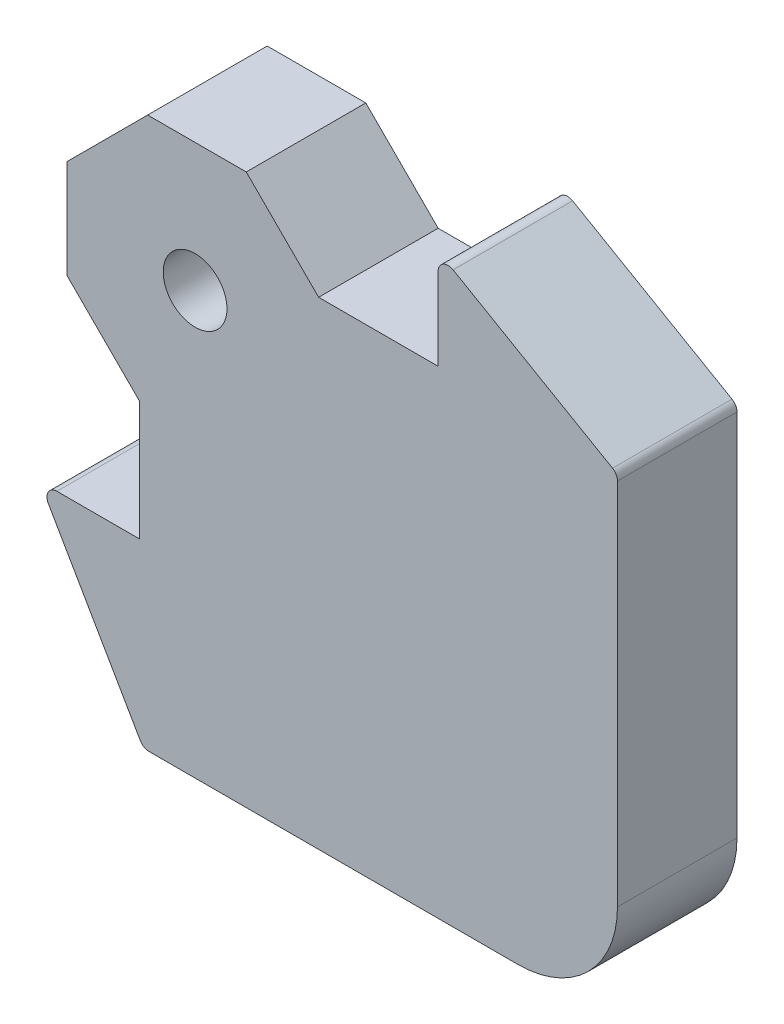
ISO-10303-21;
HEADER;
FILE_DESCRIPTION(('STEP AP214'),'2;1');
FILE_NAME('part.step','',(''),(''),'','','');
FILE_SCHEMA(('AUTOMOTIVE_DESIGN { 1 0 10303 214 1 1 1 1 }'));
ENDSEC;
DATA;
#1=APPLICATION_CONTEXT('core data for automotive mechanical design processes');
#2=APPLICATION_PROTOCOL_DEFINITION('international standard','automotive_design',2000,#1);
#3=PRODUCT_CONTEXT('',#1,'mechanical');
#4=PRODUCT('Part','Part','',(#3));
#5=PRODUCT_RELATED_PRODUCT_CATEGORY('part','',(#4));
#6=PRODUCT_DEFINITION_FORMATION('','',#4);
#7=PRODUCT_DEFINITION_CONTEXT('part definition',#1,'design');
#8=PRODUCT_DEFINITION('design','',#6,#7);
#9=PRODUCT_DEFINITION_SHAPE('','',#8);
#10=(LENGTH_UNIT() NAMED_UNIT(*) SI_UNIT(.MILLI.,.METRE.));
#11=(NAMED_UNIT(*) PLANE_ANGLE_UNIT() SI_UNIT($,.RADIAN.));
#12=(NAMED_UNIT(*) SI_UNIT($,.STERADIAN.) SOLID_ANGLE_UNIT());
#13=UNCERTAINTY_MEASURE_WITH_UNIT(LENGTH_MEASURE(1.E-05),#10,'distance_accuracy_value','');
#14=(GEOMETRIC_REPRESENTATION_CONTEXT(3) GLOBAL_UNCERTAINTY_ASSIGNED_CONTEXT((#13)) GLOBAL_UNIT_ASSIGNED_CONTEXT((#10,
#11,#12)) REPRESENTATION_CONTEXT('',''));
#15=CARTESIAN_POINT('',(0.,0.,0.));
#16=DIRECTION('',(0.,0.,1.));
#17=DIRECTION('',(1.,0.,0.));
#18=AXIS2_PLACEMENT_3D('',#15,#16,#17);
#19=CARTESIAN_POINT('',(0.,0.,3.));
#20=DIRECTION('',(0.,0.,-1.));
#21=DIRECTION('',(-1.,0.,0.));
#22=AXIS2_PLACEMENT_3D('',#19,#20,#21);
#23=PLANE('',#22);
#24=DIRECTION('',(-0.707106781186547,-0.707106781186547,0.));
#25=VECTOR('',#24,1.);
#26=CARTESIAN_POINT('',(-21.2132034355964,0.,3.));
#27=LINE('',#26,#25);
#28=CARTESIAN_POINT('',(-8.58147545195114,12.6317279836453,3.));
#29=VERTEX_POINT('',#28);
#30=CARTESIAN_POINT('',(-12.6317279836453,8.58147545195113,3.));
#31=VERTEX_POINT('',#30);
#32=EDGE_CURVE('E244',#29,#31,#27,.T.);
#33=ORIENTED_EDGE('',*,*,#32,.T.);
#34=DIRECTION('',(0.,1.,0.));
#35=VECTOR('',#34,1.);
#36=CARTESIAN_POINT('',(-12.6317279836453,8.58147545195113,3.));
#37=LINE('',#36,#35);
#38=CARTESIAN_POINT('',(-12.6317279836453,3.63172798364529,3.));
#39=VERTEX_POINT('',#38);
#40=EDGE_CURVE('E172',#31,#39,#37,.F.);
#41=ORIENTED_EDGE('',*,*,#40,.T.);
#42=DIRECTION('',(-0.707106781186548,0.707106781186547,0.));
#43=VECTOR('',#42,1.);
#44=CARTESIAN_POINT('',(-15.1066017177982,6.10660171779822,3.));
#45=LINE('',#44,#43);
#46=CARTESIAN_POINT('',(-9.,0.,3.));
#47=VERTEX_POINT('',#46);
#48=EDGE_CURVE('E158',#47,#39,#45,.T.);
#49=ORIENTED_EDGE('',*,*,#48,.F.);
#50=DIRECTION('',(0.,-1.,0.));
#51=VECTOR('',#50,1.);
#52=CARTESIAN_POINT('',(-9.,0.,3.));
#53=LINE('',#52,#51);
#54=CARTESIAN_POINT('',(-9.,-6.,3.));
#55=VERTEX_POINT('',#54);
#56=EDGE_CURVE('E170',#47,#55,#53,.T.);
#57=ORIENTED_EDGE('',*,*,#56,.T.);
#58=DIRECTION('',(-1.,0.,0.));
#59=VECTOR('',#58,1.);
#60=CARTESIAN_POINT('',(-9.,-6.,3.));
#61=LINE('',#60,#59);
#62=CARTESIAN_POINT('',(-13.1339745962156,-6.,3.));
#63=VERTEX_POINT('',#62);
#64=EDGE_CURVE('E177',#55,#63,#61,.T.);
#65=ORIENTED_EDGE('',*,*,#64,.T.);
#66=CARTESIAN_POINT('',(-13.1339745962156,-6.5,3.));
#67=DIRECTION('',(0.,0.,-1.));
#68=DIRECTION('',(-1.,0.,0.));
#69=AXIS2_PLACEMENT_3D('',#66,#67,#68);
#70=CIRCLE('',#69,0.5);
#71=CARTESIAN_POINT('',(-13.5669872981078,-6.75,3.));
#72=VERTEX_POINT('',#71);
#73=EDGE_CURVE('E266',#63,#72,#70,.F.);
#74=ORIENTED_EDGE('',*,*,#73,.T.);
#75=DIRECTION('',(0.500000000000004,-0.866025403784436,0.));
#76=VECTOR('',#75,1.);
#77=CARTESIAN_POINT('',(-14.,-6.,3.));
#78=LINE('',#77,#76);
#79=CARTESIAN_POINT('',(-8.94818514459072,-14.75,3.));
#80=VERTEX_POINT('',#79);
#81=EDGE_CURVE('E180',#72,#80,#78,.T.);
#82=ORIENTED_EDGE('',*,*,#81,.T.);
#83=CARTESIAN_POINT('',(-8.5151724426985,-14.5,3.));
#84=DIRECTION('',(0.,0.,-1.));
#85=DIRECTION('',(-1.,0.,0.));
#86=AXIS2_PLACEMENT_3D('',#83,#84,#85);
#87=CIRCLE('',#86,0.5);
#88=CARTESIAN_POINT('',(-8.5151724426985,-15.,3.));
#89=VERTEX_POINT('',#88);
#90=EDGE_CURVE('E270',#80,#89,#87,.F.);
#91=ORIENTED_EDGE('',*,*,#90,.T.);
#92=DIRECTION('',(1.,0.,0.));
#93=VECTOR('',#92,1.);
#94=CARTESIAN_POINT('',(-8.80384757729331,-15.,3.));
#95=LINE('',#94,#93);
#96=CARTESIAN_POINT('',(10.,-15.,3.));
#97=VERTEX_POINT('',#96);
#98=EDGE_CURVE('E191',#89,#97,#95,.T.);
#99=ORIENTED_EDGE('',*,*,#98,.T.);
#100=CARTESIAN_POINT('',(10.,-10.,3.));
#101=DIRECTION('',(0.,0.,1.));
#102=DIRECTION('',(-1.,0.,0.));
#103=AXIS2_PLACEMENT_3D('',#100,#101,#102);
#104=CIRCLE('',#103,5.);
#105=CARTESIAN_POINT('',(15.,-10.,3.));
#106=VERTEX_POINT('',#105);
#107=EDGE_CURVE('E193',#97,#106,#104,.T.);
#108=ORIENTED_EDGE('',*,*,#107,.T.);
#109=DIRECTION('',(0.,1.,0.));
#110=VECTOR('',#109,1.);
#111=CARTESIAN_POINT('',(15.,8.80384757729332,3.));
#112=LINE('',#111,#110);
#113=CARTESIAN_POINT('',(15.,8.5151724426985,3.));
#114=VERTEX_POINT('',#113);
#115=EDGE_CURVE('E195',#106,#114,#112,.T.);
#116=ORIENTED_EDGE('',*,*,#115,.T.);
#117=CARTESIAN_POINT('',(14.5,8.5151724426985,3.));
#118=DIRECTION('',(0.,0.,-1.));
#119=DIRECTION('',(-1.,0.,0.));
#120=AXIS2_PLACEMENT_3D('',#117,#118,#119);
#121=CIRCLE('',#120,0.5);
#122=CARTESIAN_POINT('',(14.75,8.94818514459072,3.));
#123=VERTEX_POINT('',#122);
#124=EDGE_CURVE('E268',#114,#123,#121,.F.);
#125=ORIENTED_EDGE('',*,*,#124,.T.);
#126=DIRECTION('',(-0.866025403784436,0.500000000000004,0.));
#127=VECTOR('',#126,1.);
#128=CARTESIAN_POINT('',(6.,14.,3.));
#129=LINE('',#128,#127);
#130=CARTESIAN_POINT('',(6.75,13.5669872981078,3.));
#131=VERTEX_POINT('',#130);
#132=EDGE_CURVE('E198',#123,#131,#129,.T.);
#133=ORIENTED_EDGE('',*,*,#132,.T.);
#134=CARTESIAN_POINT('',(6.5,13.1339745962156,3.));
#135=DIRECTION('',(0.,0.,-1.));
#136=DIRECTION('',(-1.,0.,0.));
#137=AXIS2_PLACEMENT_3D('',#134,#135,#136);
#138=CIRCLE('',#137,0.5);
#139=CARTESIAN_POINT('',(6.,13.1339745962156,3.));
#140=VERTEX_POINT('',#139);
#141=EDGE_CURVE('E264',#131,#140,#138,.F.);
#142=ORIENTED_EDGE('',*,*,#141,.T.);
#143=DIRECTION('',(0.,-1.,0.));
#144=VECTOR('',#143,1.);
#145=CARTESIAN_POINT('',(6.,9.,3.));
#146=LINE('',#145,#144);
#147=CARTESIAN_POINT('',(6.,9.,3.));
#148=VERTEX_POINT('',#147);
#149=EDGE_CURVE('E201',#140,#148,#146,.T.);
#150=ORIENTED_EDGE('',*,*,#149,.T.);
#151=DIRECTION('',(-1.,0.,0.));
#152=VECTOR('',#151,1.);
#153=CARTESIAN_POINT('',(0.,9.,3.));
#154=LINE('',#153,#152);
#155=CARTESIAN_POINT('',(0.,9.00000000000001,3.));
#156=VERTEX_POINT('',#155);
#157=EDGE_CURVE('E203',#148,#156,#154,.T.);
#158=ORIENTED_EDGE('',*,*,#157,.T.);
#159=DIRECTION('',(0.707106781186548,-0.707106781186547,0.));
#160=VECTOR('',#159,1.);
#161=CARTESIAN_POINT('',(0.,9.,3.));
#162=LINE('',#161,#160);
#163=CARTESIAN_POINT('',(-3.63172798364529,12.6317279836453,3.));
#164=VERTEX_POINT('',#163);
#165=EDGE_CURVE('E186',#164,#156,#162,.T.);
#166=ORIENTED_EDGE('',*,*,#165,.F.);
#167=DIRECTION('',(1.,0.,0.));
#168=VECTOR('',#167,1.);
#169=CARTESIAN_POINT('',(-3.63172798364529,12.6317279836453,3.));
#170=LINE('',#169,#168);
#171=EDGE_CURVE('E289',#164,#29,#170,.F.);
#172=ORIENTED_EDGE('',*,*,#171,.T.);
#173=EDGE_LOOP('',(#33,#41,#49,#57,#65,#74,#82,#91,#99,#108,#116,#125,#133,#142,#150,#158,#166,#172));
#174=FACE_BOUND('',#173,.T.);
#175=CARTESIAN_POINT('',(-6.2,6.2,3.));
#176=DIRECTION('',(0.,0.,1.));
#177=DIRECTION('',(1.,0.,0.));
#178=AXIS2_PLACEMENT_3D('',#175,#176,#177);
#179=CIRCLE('',#178,1.6);
#180=CARTESIAN_POINT('',(-4.6,6.2,3.));
#181=VERTEX_POINT('',#180);
#182=EDGE_CURVE('E238',#181,#181,#179,.T.);
#183=ORIENTED_EDGE('',*,*,#182,.F.);
#184=EDGE_LOOP('',(#183));
#185=FACE_BOUND('',#184,.T.);
#186=ADVANCED_FACE('F30',(#174,#185),#23,.F.);
#187=CARTESIAN_POINT('',(0.,0.,-3.));
#188=DIRECTION('',(0.,0.,-1.));
#189=DIRECTION('',(-1.,0.,0.));
#190=AXIS2_PLACEMENT_3D('',#187,#188,#189);
#191=PLANE('',#190);
#192=DIRECTION('',(-0.707106781186548,0.707106781186547,0.));
#193=VECTOR('',#192,1.);
#194=CARTESIAN_POINT('',(-15.1066017177982,6.10660171779822,-3.));
#195=LINE('',#194,#193);
#196=CARTESIAN_POINT('',(-9.,0.,-3.));
#197=VERTEX_POINT('',#196);
#198=CARTESIAN_POINT('',(-12.6317279836453,3.63172798364529,-3.));
#199=VERTEX_POINT('',#198);
#200=EDGE_CURVE('E159',#197,#199,#195,.T.);
#201=ORIENTED_EDGE('',*,*,#200,.T.);
#202=DIRECTION('',(0.,-1.,0.));
#203=VECTOR('',#202,1.);
#204=CARTESIAN_POINT('',(-12.6317279836453,0.,-3.));
#205=LINE('',#204,#203);
#206=CARTESIAN_POINT('',(-12.6317279836453,8.58147545195113,-3.));
#207=VERTEX_POINT('',#206);
#208=EDGE_CURVE('E38',#199,#207,#205,.F.);
#209=ORIENTED_EDGE('',*,*,#208,.T.);
#210=DIRECTION('',(-0.707106781186547,-0.707106781186547,0.));
#211=VECTOR('',#210,1.);
#212=CARTESIAN_POINT('',(-21.2132034355964,0.,-3.));
#213=LINE('',#212,#211);
#214=CARTESIAN_POINT('',(-8.58147545195114,12.6317279836453,-3.));
#215=VERTEX_POINT('',#214);
#216=EDGE_CURVE('E241',#215,#207,#213,.T.);
#217=ORIENTED_EDGE('',*,*,#216,.F.);
#218=DIRECTION('',(-1.,0.,0.));
#219=VECTOR('',#218,1.);
#220=CARTESIAN_POINT('',(0.,12.6317279836453,-3.));
#221=LINE('',#220,#219);
#222=CARTESIAN_POINT('',(-3.63172798364529,12.6317279836453,-3.));
#223=VERTEX_POINT('',#222);
#224=EDGE_CURVE('E45',#215,#223,#221,.F.);
#225=ORIENTED_EDGE('',*,*,#224,.T.);
#226=DIRECTION('',(0.707106781186548,-0.707106781186547,0.));
#227=VECTOR('',#226,1.);
#228=CARTESIAN_POINT('',(0.,9.,-3.));
#229=LINE('',#228,#227);
#230=CARTESIAN_POINT('',(0.,9.00000000000001,-3.));
#231=VERTEX_POINT('',#230);
#232=EDGE_CURVE('E358',#223,#231,#229,.T.);
#233=ORIENTED_EDGE('',*,*,#232,.T.);
#234=DIRECTION('',(-1.,0.,0.));
#235=VECTOR('',#234,1.);
#236=CARTESIAN_POINT('',(0.,9.,-3.));
#237=LINE('',#236,#235);
#238=CARTESIAN_POINT('',(6.,9.,-3.));
#239=VERTEX_POINT('',#238);
#240=EDGE_CURVE('E178',#239,#231,#237,.T.);
#241=ORIENTED_EDGE('',*,*,#240,.F.);
#242=DIRECTION('',(0.,-1.,0.));
#243=VECTOR('',#242,1.);
#244=CARTESIAN_POINT('',(6.,9.,-3.));
#245=LINE('',#244,#243);
#246=CARTESIAN_POINT('',(6.,13.1339745962156,-3.));
#247=VERTEX_POINT('',#246);
#248=EDGE_CURVE('E183',#247,#239,#245,.T.);
#249=ORIENTED_EDGE('',*,*,#248,.F.);
#250=CARTESIAN_POINT('',(6.5,13.1339745962156,-3.));
#251=DIRECTION('',(0.,0.,-1.));
#252=DIRECTION('',(-1.,0.,0.));
#253=AXIS2_PLACEMENT_3D('',#250,#251,#252);
#254=CIRCLE('',#253,0.5);
#255=CARTESIAN_POINT('',(6.75,13.5669872981078,-3.));
#256=VERTEX_POINT('',#255);
#257=EDGE_CURVE('E251',#247,#256,#254,.T.);
#258=ORIENTED_EDGE('',*,*,#257,.T.);
#259=DIRECTION('',(-0.866025403784436,0.500000000000004,0.));
#260=VECTOR('',#259,1.);
#261=CARTESIAN_POINT('',(6.,14.,-3.));
#262=LINE('',#261,#260);
#263=CARTESIAN_POINT('',(14.75,8.94818514459072,-3.));
#264=VERTEX_POINT('',#263);
#265=EDGE_CURVE('E222',#264,#256,#262,.T.);
#266=ORIENTED_EDGE('',*,*,#265,.F.);
#267=CARTESIAN_POINT('',(14.5,8.5151724426985,-3.));
#268=DIRECTION('',(0.,0.,-1.));
#269=DIRECTION('',(-1.,0.,0.));
#270=AXIS2_PLACEMENT_3D('',#267,#268,#269);
#271=CIRCLE('',#270,0.5);
#272=CARTESIAN_POINT('',(15.,8.5151724426985,-3.));
#273=VERTEX_POINT('',#272);
#274=EDGE_CURVE('E255',#264,#273,#271,.T.);
#275=ORIENTED_EDGE('',*,*,#274,.T.);
#276=DIRECTION('',(0.,1.,0.));
#277=VECTOR('',#276,1.);
#278=CARTESIAN_POINT('',(15.,8.80384757729332,-3.));
#279=LINE('',#278,#277);
#280=CARTESIAN_POINT('',(15.,-10.,-3.));
#281=VERTEX_POINT('',#280);
#282=EDGE_CURVE('E219',#281,#273,#279,.T.);
#283=ORIENTED_EDGE('',*,*,#282,.F.);
#284=CARTESIAN_POINT('',(10.,-10.,-3.));
#285=DIRECTION('',(0.,0.,1.));
#286=DIRECTION('',(-1.,0.,0.));
#287=AXIS2_PLACEMENT_3D('',#284,#285,#286);
#288=CIRCLE('',#287,5.);
#289=CARTESIAN_POINT('',(10.,-15.,-3.));
#290=VERTEX_POINT('',#289);
#291=EDGE_CURVE('E217',#290,#281,#288,.T.);
#292=ORIENTED_EDGE('',*,*,#291,.F.);
#293=DIRECTION('',(1.,0.,0.));
#294=VECTOR('',#293,1.);
#295=CARTESIAN_POINT('',(-8.80384757729331,-15.,-3.));
#296=LINE('',#295,#294);
#297=CARTESIAN_POINT('',(-8.5151724426985,-15.,-3.));
#298=VERTEX_POINT('',#297);
#299=EDGE_CURVE('E215',#298,#290,#296,.T.);
#300=ORIENTED_EDGE('',*,*,#299,.F.);
#301=CARTESIAN_POINT('',(-8.5151724426985,-14.5,-3.));
#302=DIRECTION('',(0.,0.,-1.));
#303=DIRECTION('',(-1.,0.,0.));
#304=AXIS2_PLACEMENT_3D('',#301,#302,#303);
#305=CIRCLE('',#304,0.5);
#306=CARTESIAN_POINT('',(-8.94818514459072,-14.75,-3.));
#307=VERTEX_POINT('',#306);
#308=EDGE_CURVE('E257',#298,#307,#305,.T.);
#309=ORIENTED_EDGE('',*,*,#308,.T.);
#310=DIRECTION('',(0.500000000000004,-0.866025403784436,0.));
#311=VECTOR('',#310,1.);
#312=CARTESIAN_POINT('',(-14.,-6.,-3.));
#313=LINE('',#312,#311);
#314=CARTESIAN_POINT('',(-13.5669872981078,-6.75,-3.));
#315=VERTEX_POINT('',#314);
#316=EDGE_CURVE('E212',#315,#307,#313,.T.);
#317=ORIENTED_EDGE('',*,*,#316,.F.);
#318=CARTESIAN_POINT('',(-13.1339745962156,-6.5,-3.));
#319=DIRECTION('',(0.,0.,-1.));
#320=DIRECTION('',(-1.,0.,0.));
#321=AXIS2_PLACEMENT_3D('',#318,#319,#320);
#322=CIRCLE('',#321,0.5);
#323=CARTESIAN_POINT('',(-13.1339745962156,-6.,-3.));
#324=VERTEX_POINT('',#323);
#325=EDGE_CURVE('E253',#315,#324,#322,.T.);
#326=ORIENTED_EDGE('',*,*,#325,.T.);
#327=DIRECTION('',(-1.,0.,0.));
#328=VECTOR('',#327,1.);
#329=CARTESIAN_POINT('',(-9.,-6.,-3.));
#330=LINE('',#329,#328);
#331=CARTESIAN_POINT('',(-9.,-6.,-3.));
#332=VERTEX_POINT('',#331);
#333=EDGE_CURVE('E209',#332,#324,#330,.T.);
#334=ORIENTED_EDGE('',*,*,#333,.F.);
#335=DIRECTION('',(0.,-1.,0.));
#336=VECTOR('',#335,1.);
#337=CARTESIAN_POINT('',(-9.,0.,-3.));
#338=LINE('',#337,#336);
#339=EDGE_CURVE('E207',#197,#332,#338,.T.);
#340=ORIENTED_EDGE('',*,*,#339,.F.);
#341=EDGE_LOOP('',(#201,#209,#217,#225,#233,#241,#249,#258,#266,#275,#283,#292,#300,#309,#317,
#326,#334,#340));
#342=FACE_BOUND('',#341,.T.);
#343=CARTESIAN_POINT('',(-6.2,6.2,-3.));
#344=DIRECTION('',(0.,0.,1.));
#345=DIRECTION('',(1.,0.,0.));
#346=AXIS2_PLACEMENT_3D('',#343,#344,#345);
#347=CIRCLE('',#346,1.6);
#348=CARTESIAN_POINT('',(-4.6,6.2,-3.));
#349=VERTEX_POINT('',#348);
#350=EDGE_CURVE('E163',#349,#349,#347,.T.);
#351=ORIENTED_EDGE('',*,*,#350,.T.);
#352=EDGE_LOOP('',(#351));
#353=FACE_BOUND('',#352,.T.);
#354=ADVANCED_FACE('F294',(#342,#353),#191,.T.);
#355=CARTESIAN_POINT('',(-21.2132034355964,0.,3.));
#356=DIRECTION('',(0.707106781186548,-0.707106781186548,0.));
#357=DIRECTION('',(0.707106781186548,0.707106781186548,0.));
#358=AXIS2_PLACEMENT_3D('',#355,#356,#357);
#359=PLANE('',#358);
#360=ORIENTED_EDGE('',*,*,#216,.T.);
#361=DIRECTION('',(0.,0.,1.));
#362=VECTOR('',#361,1.);
#363=CARTESIAN_POINT('',(-12.6317279836453,8.58147545195113,3.));
#364=LINE('',#363,#362);
#365=EDGE_CURVE('E286',#207,#31,#364,.T.);
#366=ORIENTED_EDGE('',*,*,#365,.T.);
#367=ORIENTED_EDGE('',*,*,#32,.F.);
#368=DIRECTION('',(0.,0.,-1.));
#369=VECTOR('',#368,1.);
#370=CARTESIAN_POINT('',(-8.58147545195114,12.6317279836453,3.));
#371=LINE('',#370,#369);
#372=EDGE_CURVE('E284',#29,#215,#371,.T.);
#373=ORIENTED_EDGE('',*,*,#372,.T.);
#374=EDGE_LOOP('',(#360,#366,#367,#373));
#375=FACE_BOUND('',#374,.T.);
#376=ADVANCED_FACE('F299',(#375),#359,.F.);
#377=CARTESIAN_POINT('',(-6.2,6.2,3.));
#378=DIRECTION('',(0.,0.,-1.));
#379=DIRECTION('',(-1.,0.,0.));
#380=AXIS2_PLACEMENT_3D('',#377,#378,#379);
#381=CYLINDRICAL_SURFACE('',#380,1.6);
#382=ORIENTED_EDGE('',*,*,#182,.T.);
#383=EDGE_LOOP('',(#382));
#384=FACE_BOUND('',#383,.T.);
#385=ORIENTED_EDGE('',*,*,#350,.F.);
#386=EDGE_LOOP('',(#385));
#387=FACE_BOUND('',#386,.T.);
#388=ADVANCED_FACE('F319',(#384,#387),#381,.F.);
#389=CARTESIAN_POINT('',(-9.,0.,3.));
#390=DIRECTION('',(1.,0.,0.));
#391=DIRECTION('',(0.,0.,-1.));
#392=AXIS2_PLACEMENT_3D('',#389,#390,#391);
#393=PLANE('',#392);
#394=ORIENTED_EDGE('',*,*,#339,.T.);
#395=DIRECTION('',(0.,0.,-1.));
#396=VECTOR('',#395,1.);
#397=CARTESIAN_POINT('',(-9.,-6.,3.));
#398=LINE('',#397,#396);
#399=EDGE_CURVE('E164',#55,#332,#398,.T.);
#400=ORIENTED_EDGE('',*,*,#399,.F.);
#401=ORIENTED_EDGE('',*,*,#56,.F.);
#402=DIRECTION('',(0.,0.,-1.));
#403=VECTOR('',#402,1.);
#404=CARTESIAN_POINT('',(-9.,0.,3.));
#405=LINE('',#404,#403);
#406=EDGE_CURVE('E155',#47,#197,#405,.T.);
#407=ORIENTED_EDGE('',*,*,#406,.T.);
#408=EDGE_LOOP('',(#394,#400,#401,#407));
#409=FACE_BOUND('',#408,.T.);
#410=ADVANCED_FACE('F174',(#409),#393,.F.);
#411=CARTESIAN_POINT('',(-9.,-6.,3.));
#412=DIRECTION('',(0.,-1.,0.));
#413=DIRECTION('',(0.,0.,-1.));
#414=AXIS2_PLACEMENT_3D('',#411,#412,#413);
#415=PLANE('',#414);
#416=ORIENTED_EDGE('',*,*,#333,.T.);
#417=DIRECTION('',(0.,0.,-1.));
#418=VECTOR('',#417,1.);
#419=CARTESIAN_POINT('',(-13.1339745962156,-6.,3.));
#420=LINE('',#419,#418);
#421=EDGE_CURVE('E279',#324,#63,#420,.F.);
#422=ORIENTED_EDGE('',*,*,#421,.T.);
#423=ORIENTED_EDGE('',*,*,#64,.F.);
#424=ORIENTED_EDGE('',*,*,#399,.T.);
#425=EDGE_LOOP('',(#416,#422,#423,#424));
#426=FACE_BOUND('',#425,.T.);
#427=ADVANCED_FACE('F393',(#426),#415,.F.);
#428=CARTESIAN_POINT('',(-14.,-6.,3.));
#429=DIRECTION('',(0.866025403784436,0.500000000000004,0.));
#430=DIRECTION('',(-0.500000000000004,0.866025403784436,0.));
#431=AXIS2_PLACEMENT_3D('',#428,#429,#430);
#432=PLANE('',#431);
#433=ORIENTED_EDGE('',*,*,#316,.T.);
#434=DIRECTION('',(0.,0.,-1.));
#435=VECTOR('',#434,1.);
#436=CARTESIAN_POINT('',(-8.94818514459072,-14.75,3.));
#437=LINE('',#436,#435);
#438=EDGE_CURVE('E262',#307,#80,#437,.F.);
#439=ORIENTED_EDGE('',*,*,#438,.T.);
#440=ORIENTED_EDGE('',*,*,#81,.F.);
#441=DIRECTION('',(0.,0.,-1.));
#442=VECTOR('',#441,1.);
#443=CARTESIAN_POINT('',(-13.5669872981078,-6.75,3.));
#444=LINE('',#443,#442);
#445=EDGE_CURVE('E259',#72,#315,#444,.T.);
#446=ORIENTED_EDGE('',*,*,#445,.T.);
#447=EDGE_LOOP('',(#433,#439,#440,#446));
#448=FACE_BOUND('',#447,.T.);
#449=ADVANCED_FACE('F387',(#448),#432,.F.);
#450=CARTESIAN_POINT('',(-8.80384757729331,-15.,3.));
#451=DIRECTION('',(0.,1.,0.));
#452=DIRECTION('',(0.,0.,1.));
#453=AXIS2_PLACEMENT_3D('',#450,#451,#452);
#454=PLANE('',#453);
#455=ORIENTED_EDGE('',*,*,#98,.F.);
#456=DIRECTION('',(0.,0.,-1.));
#457=VECTOR('',#456,1.);
#458=CARTESIAN_POINT('',(-8.5151724426985,-15.,3.));
#459=LINE('',#458,#457);
#460=EDGE_CURVE('E246',#89,#298,#459,.T.);
#461=ORIENTED_EDGE('',*,*,#460,.T.);
#462=ORIENTED_EDGE('',*,*,#299,.T.);
#463=DIRECTION('',(0.,0.,-1.));
#464=VECTOR('',#463,1.);
#465=CARTESIAN_POINT('',(10.,-15.,3.));
#466=LINE('',#465,#464);
#467=EDGE_CURVE('E234',#97,#290,#466,.T.);
#468=ORIENTED_EDGE('',*,*,#467,.F.);
#469=EDGE_LOOP('',(#455,#461,#462,#468));
#470=FACE_BOUND('',#469,.T.);
#471=ADVANCED_FACE('F381',(#470),#454,.F.);
#472=CARTESIAN_POINT('',(10.,-10.,3.));
#473=DIRECTION('',(0.,0.,-1.));
#474=DIRECTION('',(-1.,0.,0.));
#475=AXIS2_PLACEMENT_3D('',#472,#473,#474);
#476=CYLINDRICAL_SURFACE('',#475,5.);
#477=ORIENTED_EDGE('',*,*,#291,.T.);
#478=DIRECTION('',(0.,0.,-1.));
#479=VECTOR('',#478,1.);
#480=CARTESIAN_POINT('',(15.,-10.,3.));
#481=LINE('',#480,#479);
#482=EDGE_CURVE('E231',#106,#281,#481,.T.);
#483=ORIENTED_EDGE('',*,*,#482,.F.);
#484=ORIENTED_EDGE('',*,*,#107,.F.);
#485=ORIENTED_EDGE('',*,*,#467,.T.);
#486=EDGE_LOOP('',(#477,#483,#484,#485));
#487=FACE_BOUND('',#486,.T.);
#488=ADVANCED_FACE('F375',(#487),#476,.T.);
#489=CARTESIAN_POINT('',(15.,8.80384757729332,3.));
#490=DIRECTION('',(-1.,0.,0.));
#491=DIRECTION('',(0.,-1.,0.));
#492=AXIS2_PLACEMENT_3D('',#489,#490,#491);
#493=PLANE('',#492);
#494=ORIENTED_EDGE('',*,*,#282,.T.);
#495=DIRECTION('',(0.,0.,-1.));
#496=VECTOR('',#495,1.);
#497=CARTESIAN_POINT('',(15.,8.5151724426985,3.));
#498=LINE('',#497,#496);
#499=EDGE_CURVE('E277',#273,#114,#498,.F.);
#500=ORIENTED_EDGE('',*,*,#499,.T.);
#501=ORIENTED_EDGE('',*,*,#115,.F.);
#502=ORIENTED_EDGE('',*,*,#482,.T.);
#503=EDGE_LOOP('',(#494,#500,#501,#502));
#504=FACE_BOUND('',#503,.T.);
#505=ADVANCED_FACE('F370',(#504),#493,.F.);
#506=CARTESIAN_POINT('',(6.,14.,3.));
#507=DIRECTION('',(-0.500000000000004,-0.866025403784436,0.));
#508=DIRECTION('',(0.866025403784437,-0.500000000000004,0.));
#509=AXIS2_PLACEMENT_3D('',#506,#507,#508);
#510=PLANE('',#509);
#511=ORIENTED_EDGE('',*,*,#132,.F.);
#512=DIRECTION('',(0.,0.,-1.));
#513=VECTOR('',#512,1.);
#514=CARTESIAN_POINT('',(14.75,8.94818514459072,3.));
#515=LINE('',#514,#513);
#516=EDGE_CURVE('E274',#123,#264,#515,.T.);
#517=ORIENTED_EDGE('',*,*,#516,.T.);
#518=ORIENTED_EDGE('',*,*,#265,.T.);
#519=DIRECTION('',(0.,0.,-1.));
#520=VECTOR('',#519,1.);
#521=CARTESIAN_POINT('',(6.75,13.5669872981078,3.));
#522=LINE('',#521,#520);
#523=EDGE_CURVE('E272',#256,#131,#522,.F.);
#524=ORIENTED_EDGE('',*,*,#523,.T.);
#525=EDGE_LOOP('',(#511,#517,#518,#524));
#526=FACE_BOUND('',#525,.T.);
#527=ADVANCED_FACE('F363',(#526),#510,.F.);
#528=CARTESIAN_POINT('',(6.,9.,3.));
#529=DIRECTION('',(1.,0.,0.));
#530=DIRECTION('',(0.,1.,0.));
#531=AXIS2_PLACEMENT_3D('',#528,#529,#530);
#532=PLANE('',#531);
#533=ORIENTED_EDGE('',*,*,#149,.F.);
#534=DIRECTION('',(0.,0.,-1.));
#535=VECTOR('',#534,1.);
#536=CARTESIAN_POINT('',(6.,13.1339745962156,3.));
#537=LINE('',#536,#535);
#538=EDGE_CURVE('E281',#140,#247,#537,.T.);
#539=ORIENTED_EDGE('',*,*,#538,.T.);
#540=ORIENTED_EDGE('',*,*,#248,.T.);
#541=DIRECTION('',(0.,0.,-1.));
#542=VECTOR('',#541,1.);
#543=CARTESIAN_POINT('',(6.,9.,3.));
#544=LINE('',#543,#542);
#545=EDGE_CURVE('E228',#148,#239,#544,.T.);
#546=ORIENTED_EDGE('',*,*,#545,.F.);
#547=EDGE_LOOP('',(#533,#539,#540,#546));
#548=FACE_BOUND('',#547,.T.);
#549=ADVANCED_FACE('F351',(#548),#532,.F.);
#550=CARTESIAN_POINT('',(0.,9.,3.));
#551=DIRECTION('',(0.,-1.,0.));
#552=DIRECTION('',(0.,0.,-1.));
#553=AXIS2_PLACEMENT_3D('',#550,#551,#552);
#554=PLANE('',#553);
#555=ORIENTED_EDGE('',*,*,#240,.T.);
#556=DIRECTION('',(0.,0.,-1.));
#557=VECTOR('',#556,1.);
#558=CARTESIAN_POINT('',(0.,9.,3.));
#559=LINE('',#558,#557);
#560=EDGE_CURVE('E206',#156,#231,#559,.T.);
#561=ORIENTED_EDGE('',*,*,#560,.F.);
#562=ORIENTED_EDGE('',*,*,#157,.F.);
#563=ORIENTED_EDGE('',*,*,#545,.T.);
#564=EDGE_LOOP('',(#555,#561,#562,#563));
#565=FACE_BOUND('',#564,.T.);
#566=ADVANCED_FACE('F328',(#565),#554,.F.);
#567=CARTESIAN_POINT('',(-8.5151724426985,-14.5,3.));
#568=DIRECTION('',(0.,0.,-1.));
#569=DIRECTION('',(-1.,0.,0.));
#570=AXIS2_PLACEMENT_3D('',#567,#568,#569);
#571=CYLINDRICAL_SURFACE('',#570,0.5);
#572=ORIENTED_EDGE('',*,*,#90,.F.);
#573=ORIENTED_EDGE('',*,*,#438,.F.);
#574=ORIENTED_EDGE('',*,*,#308,.F.);
#575=ORIENTED_EDGE('',*,*,#460,.F.);
#576=EDGE_LOOP('',(#572,#573,#574,#575));
#577=FACE_BOUND('',#576,.T.);
#578=ADVANCED_FACE('F324',(#577),#571,.T.);
#579=CARTESIAN_POINT('',(14.5,8.5151724426985,3.));
#580=DIRECTION('',(0.,0.,-1.));
#581=DIRECTION('',(-1.,0.,0.));
#582=AXIS2_PLACEMENT_3D('',#579,#580,#581);
#583=CYLINDRICAL_SURFACE('',#582,0.5);
#584=ORIENTED_EDGE('',*,*,#124,.F.);
#585=ORIENTED_EDGE('',*,*,#499,.F.);
#586=ORIENTED_EDGE('',*,*,#274,.F.);
#587=ORIENTED_EDGE('',*,*,#516,.F.);
#588=EDGE_LOOP('',(#584,#585,#586,#587));
#589=FACE_BOUND('',#588,.T.);
#590=ADVANCED_FACE('F327',(#589),#583,.T.);
#591=CARTESIAN_POINT('',(-13.1339745962156,-6.5,3.));
#592=DIRECTION('',(0.,0.,-1.));
#593=DIRECTION('',(-1.,0.,0.));
#594=AXIS2_PLACEMENT_3D('',#591,#592,#593);
#595=CYLINDRICAL_SURFACE('',#594,0.5);
#596=ORIENTED_EDGE('',*,*,#73,.F.);
#597=ORIENTED_EDGE('',*,*,#421,.F.);
#598=ORIENTED_EDGE('',*,*,#325,.F.);
#599=ORIENTED_EDGE('',*,*,#445,.F.);
#600=EDGE_LOOP('',(#596,#597,#598,#599));
#601=FACE_BOUND('',#600,.T.);
#602=ADVANCED_FACE('F332',(#601),#595,.T.);
#603=CARTESIAN_POINT('',(6.5,13.1339745962156,3.));
#604=DIRECTION('',(0.,0.,-1.));
#605=DIRECTION('',(-1.,0.,0.));
#606=AXIS2_PLACEMENT_3D('',#603,#604,#605);
#607=CYLINDRICAL_SURFACE('',#606,0.5);
#608=ORIENTED_EDGE('',*,*,#141,.F.);
#609=ORIENTED_EDGE('',*,*,#523,.F.);
#610=ORIENTED_EDGE('',*,*,#257,.F.);
#611=ORIENTED_EDGE('',*,*,#538,.F.);
#612=EDGE_LOOP('',(#608,#609,#610,#611));
#613=FACE_BOUND('',#612,.T.);
#614=ADVANCED_FACE('F335',(#613),#607,.T.);
#615=CARTESIAN_POINT('',(0.,9.,-3.001));
#616=DIRECTION('',(-0.707106781186547,-0.707106781186548,0.));
#617=DIRECTION('',(0.707106781186548,-0.707106781186547,0.));
#618=AXIS2_PLACEMENT_3D('',#615,#616,#617);
#619=PLANE('',#618);
#620=ORIENTED_EDGE('',*,*,#232,.F.);
#621=DIRECTION('',(0.,0.,1.));
#622=VECTOR('',#621,1.);
#623=CARTESIAN_POINT('',(-3.63172798364529,12.6317279836453,-3.001));
#624=LINE('',#623,#622);
#625=EDGE_CURVE('E11',#223,#164,#624,.T.);
#626=ORIENTED_EDGE('',*,*,#625,.T.);
#627=ORIENTED_EDGE('',*,*,#165,.T.);
#628=ORIENTED_EDGE('',*,*,#560,.T.);
#629=EDGE_LOOP('',(#620,#626,#627,#628));
#630=FACE_BOUND('',#629,.T.);
#631=ADVANCED_FACE('F309',(#630),#619,.F.);
#632=CARTESIAN_POINT('',(-15.1066017177982,6.10660171779822,-3.001));
#633=DIRECTION('',(0.707106781186547,0.707106781186548,0.));
#634=DIRECTION('',(-0.707106781186548,0.707106781186547,0.));
#635=AXIS2_PLACEMENT_3D('',#632,#633,#634);
#636=PLANE('',#635);
#637=ORIENTED_EDGE('',*,*,#48,.T.);
#638=DIRECTION('',(0.,0.,-1.));
#639=VECTOR('',#638,1.);
#640=CARTESIAN_POINT('',(-12.6317279836453,3.63172798364529,-3.001));
#641=LINE('',#640,#639);
#642=EDGE_CURVE('E53',#39,#199,#641,.T.);
#643=ORIENTED_EDGE('',*,*,#642,.T.);
#644=ORIENTED_EDGE('',*,*,#200,.F.);
#645=ORIENTED_EDGE('',*,*,#406,.F.);
#646=EDGE_LOOP('',(#637,#643,#644,#645));
#647=FACE_BOUND('',#646,.T.);
#648=ADVANCED_FACE('F157',(#647),#636,.F.);
#649=CARTESIAN_POINT('',(-12.6317279836453,8.58147545195113,3.));
#650=DIRECTION('',(1.,0.,0.));
#651=DIRECTION('',(0.,1.,0.));
#652=AXIS2_PLACEMENT_3D('',#649,#650,#651);
#653=PLANE('',#652);
#654=ORIENTED_EDGE('',*,*,#208,.F.);
#655=ORIENTED_EDGE('',*,*,#642,.F.);
#656=ORIENTED_EDGE('',*,*,#40,.F.);
#657=ORIENTED_EDGE('',*,*,#365,.F.);
#658=EDGE_LOOP('',(#654,#655,#656,#657));
#659=FACE_BOUND('',#658,.T.);
#660=ADVANCED_FACE('F302',(#659),#653,.F.);
#661=CARTESIAN_POINT('',(-3.63172798364529,12.6317279836453,-3.001));
#662=DIRECTION('',(0.,-1.,0.));
#663=DIRECTION('',(1.,0.,0.));
#664=AXIS2_PLACEMENT_3D('',#661,#662,#663);
#665=PLANE('',#664);
#666=ORIENTED_EDGE('',*,*,#224,.F.);
#667=ORIENTED_EDGE('',*,*,#372,.F.);
#668=ORIENTED_EDGE('',*,*,#171,.F.);
#669=ORIENTED_EDGE('',*,*,#625,.F.);
#670=EDGE_LOOP('',(#666,#667,#668,#669));
#671=FACE_BOUND('',#670,.T.);
#672=ADVANCED_FACE('F32',(#671),#665,.F.);
#673=CLOSED_SHELL('',(#186,#354,#376,#388,#410,#427,#449,#471,#488,#505,#527,#549,#566,#578,
#590,#602,#614,#631,#648,#660,#672));
#674=MANIFOLD_SOLID_BREP('B2',#673);
#675=ADVANCED_BREP_SHAPE_REPRESENTATION('',(#18,#674),#14);
#676=SHAPE_DEFINITION_REPRESENTATION(#9,#675);
ENDSEC;
END-ISO-10303-21;
